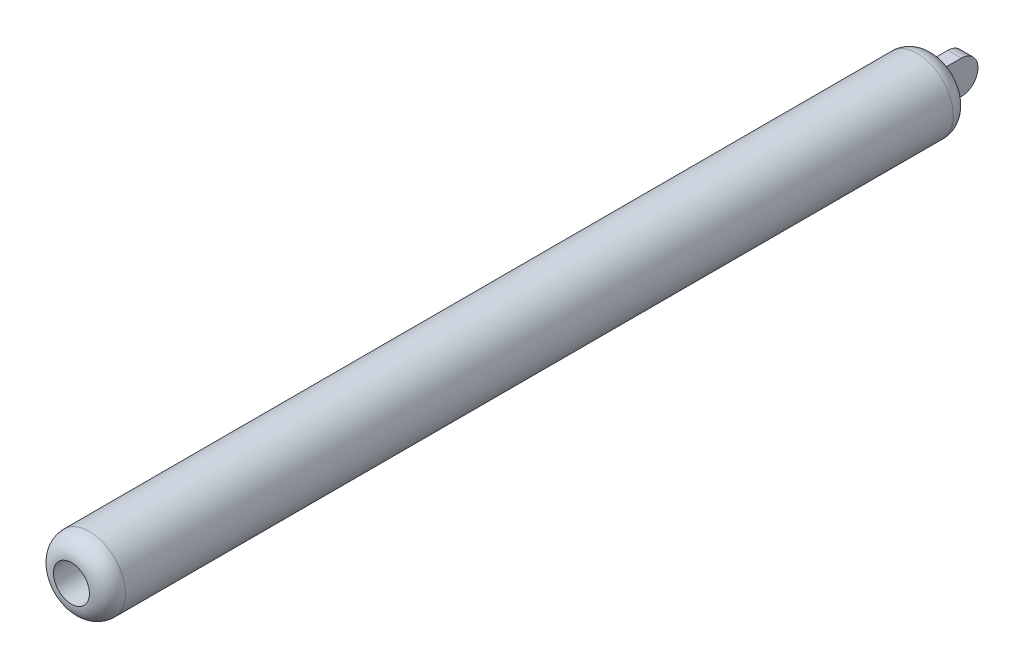
ISO-10303-21;
HEADER;
FILE_DESCRIPTION(('STEP AP214'),'2;1');
FILE_NAME('part.step','',(''),(''),'','','');
FILE_SCHEMA(('AUTOMOTIVE_DESIGN { 1 0 10303 214 1 1 1 1 }'));
ENDSEC;
DATA;
#1=APPLICATION_CONTEXT('core data for automotive mechanical design processes');
#2=APPLICATION_PROTOCOL_DEFINITION('international standard','automotive_design',2000,#1);
#3=PRODUCT_CONTEXT('',#1,'mechanical');
#4=PRODUCT('Part','Part','',(#3));
#5=PRODUCT_RELATED_PRODUCT_CATEGORY('part','',(#4));
#6=PRODUCT_DEFINITION_FORMATION('','',#4);
#7=PRODUCT_DEFINITION_CONTEXT('part definition',#1,'design');
#8=PRODUCT_DEFINITION('design','',#6,#7);
#9=PRODUCT_DEFINITION_SHAPE('','',#8);
#10=(LENGTH_UNIT() NAMED_UNIT(*) SI_UNIT(.MILLI.,.METRE.));
#11=(NAMED_UNIT(*) PLANE_ANGLE_UNIT() SI_UNIT($,.RADIAN.));
#12=(NAMED_UNIT(*) SI_UNIT($,.STERADIAN.) SOLID_ANGLE_UNIT());
#13=UNCERTAINTY_MEASURE_WITH_UNIT(LENGTH_MEASURE(1.E-05),#10,'distance_accuracy_value','');
#14=(GEOMETRIC_REPRESENTATION_CONTEXT(3) GLOBAL_UNCERTAINTY_ASSIGNED_CONTEXT((#13)) GLOBAL_UNIT_ASSIGNED_CONTEXT((#10,
#11,#12)) REPRESENTATION_CONTEXT('',''));
#15=CARTESIAN_POINT('',(0.,0.,0.));
#16=DIRECTION('',(0.,0.,1.));
#17=DIRECTION('',(1.,0.,0.));
#18=AXIS2_PLACEMENT_3D('',#15,#16,#17);
#19=CARTESIAN_POINT('',(-1.190625,0.,-79.6066962254339));
#20=DIRECTION('',(1.,0.,0.));
#21=DIRECTION('',(0.,1.,0.));
#22=AXIS2_PLACEMENT_3D('',#19,#20,#21);
#23=CYLINDRICAL_SURFACE('',#22,2.94330377456609);
#24=CARTESIAN_POINT('',(1.190625,0.,-79.6066962254339));
#25=DIRECTION('',(1.,0.,0.));
#26=DIRECTION('',(0.,0.,1.));
#27=AXIS2_PLACEMENT_3D('',#24,#25,#26);
#28=CIRCLE('',#27,2.94330377456609);
#29=CARTESIAN_POINT('',(1.190625,-2.94330377456609,-79.6066962254339));
#30=VERTEX_POINT('',#29);
#31=CARTESIAN_POINT('',(1.190625,2.94330377456609,-79.6066962254339));
#32=VERTEX_POINT('',#31);
#33=EDGE_CURVE('E33',#30,#32,#28,.T.);
#34=ORIENTED_EDGE('',*,*,#33,.F.);
#35=DIRECTION('',(-1.,0.,0.));
#36=VECTOR('',#35,1.);
#37=CARTESIAN_POINT('',(-1.190625,-2.94330377456609,-79.6066962254339));
#38=LINE('',#37,#36);
#39=CARTESIAN_POINT('',(-1.190625,-2.94330377456609,-79.6066962254339));
#40=VERTEX_POINT('',#39);
#41=EDGE_CURVE('E9',#30,#40,#38,.T.);
#42=ORIENTED_EDGE('',*,*,#41,.T.);
#43=CARTESIAN_POINT('',(-1.190625,0.,-79.6066962254339));
#44=DIRECTION('',(-1.,0.,0.));
#45=DIRECTION('',(0.,1.,0.));
#46=AXIS2_PLACEMENT_3D('',#43,#44,#45);
#47=CIRCLE('',#46,2.94330377456609);
#48=CARTESIAN_POINT('',(-1.190625,2.94330377456609,-79.6066962254339));
#49=VERTEX_POINT('',#48);
#50=EDGE_CURVE('E89',#49,#40,#47,.T.);
#51=ORIENTED_EDGE('',*,*,#50,.F.);
#52=DIRECTION('',(-1.,0.,0.));
#53=VECTOR('',#52,1.);
#54=CARTESIAN_POINT('',(-1.190625,2.94330377456609,-79.6066962254339));
#55=LINE('',#54,#53);
#56=EDGE_CURVE('E88',#32,#49,#55,.T.);
#57=ORIENTED_EDGE('',*,*,#56,.F.);
#58=EDGE_LOOP('',(#34,#42,#51,#57));
#59=FACE_BOUND('',#58,.T.);
#60=ADVANCED_FACE('F15',(#59),#23,.T.);
#61=CARTESIAN_POINT('',(-1.190625,-2.94330377456609,-76.2));
#62=DIRECTION('',(0.,-1.,0.));
#63=DIRECTION('',(0.,0.,-1.));
#64=AXIS2_PLACEMENT_3D('',#61,#62,#63);
#65=PLANE('',#64);
#66=ORIENTED_EDGE('',*,*,#41,.F.);
#67=DIRECTION('',(0.,0.,-1.));
#68=VECTOR('',#67,1.);
#69=CARTESIAN_POINT('',(1.190625,-2.94330377456609,-76.2));
#70=LINE('',#69,#68);
#71=CARTESIAN_POINT('',(1.190625,-2.94330377456609,-76.2));
#72=VERTEX_POINT('',#71);
#73=EDGE_CURVE('E165',#72,#30,#70,.T.);
#74=ORIENTED_EDGE('',*,*,#73,.F.);
#75=DIRECTION('',(1.,0.,0.));
#76=VECTOR('',#75,1.);
#77=CARTESIAN_POINT('',(-0.5953125,-2.94330377456609,-76.2));
#78=LINE('',#77,#76);
#79=CARTESIAN_POINT('',(-1.190625,-2.94330377456609,-76.2));
#80=VERTEX_POINT('',#79);
#81=EDGE_CURVE('E78',#80,#72,#78,.T.);
#82=ORIENTED_EDGE('',*,*,#81,.F.);
#83=DIRECTION('',(0.,0.,-1.));
#84=VECTOR('',#83,1.);
#85=CARTESIAN_POINT('',(-1.190625,-2.94330377456609,-76.2));
#86=LINE('',#85,#84);
#87=EDGE_CURVE('E25',#80,#40,#86,.T.);
#88=ORIENTED_EDGE('',*,*,#87,.T.);
#89=EDGE_LOOP('',(#66,#74,#82,#88));
#90=FACE_BOUND('',#89,.T.);
#91=ADVANCED_FACE('F132',(#90),#65,.T.);
#92=CARTESIAN_POINT('',(1.190625,-2.94330377456609,-76.2));
#93=DIRECTION('',(1.,0.,0.));
#94=DIRECTION('',(0.,1.,0.));
#95=AXIS2_PLACEMENT_3D('',#92,#93,#94);
#96=PLANE('',#95);
#97=ORIENTED_EDGE('',*,*,#33,.T.);
#98=DIRECTION('',(0.,0.,-1.));
#99=VECTOR('',#98,1.);
#100=CARTESIAN_POINT('',(1.190625,2.94330377456609,-76.2));
#101=LINE('',#100,#99);
#102=CARTESIAN_POINT('',(1.190625,2.94330377456609,-76.2));
#103=VERTEX_POINT('',#102);
#104=EDGE_CURVE('E163',#103,#32,#101,.T.);
#105=ORIENTED_EDGE('',*,*,#104,.F.);
#106=DIRECTION('',(0.,1.,0.));
#107=VECTOR('',#106,1.);
#108=CARTESIAN_POINT('',(1.190625,-1.47165188728304,-76.2));
#109=LINE('',#108,#107);
#110=EDGE_CURVE('E102',#72,#103,#109,.T.);
#111=ORIENTED_EDGE('',*,*,#110,.F.);
#112=ORIENTED_EDGE('',*,*,#73,.T.);
#113=EDGE_LOOP('',(#97,#105,#111,#112));
#114=FACE_BOUND('',#113,.T.);
#115=ADVANCED_FACE('F136',(#114),#96,.T.);
#116=CARTESIAN_POINT('',(1.190625,2.94330377456609,-76.2));
#117=DIRECTION('',(0.,1.,0.));
#118=DIRECTION('',(0.,0.,1.));
#119=AXIS2_PLACEMENT_3D('',#116,#117,#118);
#120=PLANE('',#119);
#121=ORIENTED_EDGE('',*,*,#56,.T.);
#122=DIRECTION('',(0.,0.,-1.));
#123=VECTOR('',#122,1.);
#124=CARTESIAN_POINT('',(-1.190625,2.94330377456609,-76.2));
#125=LINE('',#124,#123);
#126=CARTESIAN_POINT('',(-1.190625,2.94330377456609,-76.2));
#127=VERTEX_POINT('',#126);
#128=EDGE_CURVE('E73',#127,#49,#125,.T.);
#129=ORIENTED_EDGE('',*,*,#128,.F.);
#130=DIRECTION('',(-1.,0.,0.));
#131=VECTOR('',#130,1.);
#132=CARTESIAN_POINT('',(0.5953125,2.94330377456609,-76.2));
#133=LINE('',#132,#131);
#134=EDGE_CURVE('E77',#103,#127,#133,.T.);
#135=ORIENTED_EDGE('',*,*,#134,.F.);
#136=ORIENTED_EDGE('',*,*,#104,.T.);
#137=EDGE_LOOP('',(#121,#129,#135,#136));
#138=FACE_BOUND('',#137,.T.);
#139=ADVANCED_FACE('F87',(#138),#120,.T.);
#140=CARTESIAN_POINT('',(-1.190625,2.94330377456609,-76.2));
#141=DIRECTION('',(-1.,0.,0.));
#142=DIRECTION('',(0.,-1.,0.));
#143=AXIS2_PLACEMENT_3D('',#140,#141,#142);
#144=PLANE('',#143);
#145=ORIENTED_EDGE('',*,*,#50,.T.);
#146=ORIENTED_EDGE('',*,*,#87,.F.);
#147=DIRECTION('',(0.,-1.,0.));
#148=VECTOR('',#147,1.);
#149=CARTESIAN_POINT('',(-1.190625,1.47165188728304,-76.2));
#150=LINE('',#149,#148);
#151=EDGE_CURVE('E70',#127,#80,#150,.T.);
#152=ORIENTED_EDGE('',*,*,#151,.F.);
#153=ORIENTED_EDGE('',*,*,#128,.T.);
#154=EDGE_LOOP('',(#145,#146,#152,#153));
#155=FACE_BOUND('',#154,.T.);
#156=ADVANCED_FACE('F71',(#155),#144,.T.);
#157=CARTESIAN_POINT('',(0.,0.,-76.2));
#158=DIRECTION('',(0.,0.,-1.));
#159=DIRECTION('',(-1.,0.,0.));
#160=AXIS2_PLACEMENT_3D('',#157,#158,#159);
#161=PLANE('',#160);
#162=ORIENTED_EDGE('',*,*,#134,.T.);
#163=CARTESIAN_POINT('',(0.,0.,-76.2));
#164=DIRECTION('',(0.,0.,1.));
#165=DIRECTION('',(1.,0.,0.));
#166=AXIS2_PLACEMENT_3D('',#163,#164,#165);
#167=CIRCLE('',#166,3.175);
#168=EDGE_CURVE('E53',#103,#127,#167,.T.);
#169=ORIENTED_EDGE('',*,*,#168,.F.);
#170=EDGE_LOOP('',(#162,#169));
#171=FACE_BOUND('',#170,.T.);
#172=ADVANCED_FACE('F81',(#171),#161,.T.);
#173=CARTESIAN_POINT('',(0.,0.,-76.2));
#174=DIRECTION('',(0.,0.,-1.));
#175=DIRECTION('',(-1.,0.,0.));
#176=AXIS2_PLACEMENT_3D('',#173,#174,#175);
#177=PLANE('',#176);
#178=ORIENTED_EDGE('',*,*,#151,.T.);
#179=CARTESIAN_POINT('',(0.,0.,-76.2));
#180=DIRECTION('',(0.,0.,1.));
#181=DIRECTION('',(1.,0.,0.));
#182=AXIS2_PLACEMENT_3D('',#179,#180,#181);
#183=CIRCLE('',#182,3.175);
#184=EDGE_CURVE('E61',#127,#80,#183,.T.);
#185=ORIENTED_EDGE('',*,*,#184,.F.);
#186=EDGE_LOOP('',(#178,#185));
#187=FACE_BOUND('',#186,.T.);
#188=ADVANCED_FACE('F91',(#187),#177,.T.);
#189=CARTESIAN_POINT('',(0.,0.,-76.2));
#190=DIRECTION('',(0.,0.,-1.));
#191=DIRECTION('',(-1.,0.,0.));
#192=AXIS2_PLACEMENT_3D('',#189,#190,#191);
#193=PLANE('',#192);
#194=ORIENTED_EDGE('',*,*,#81,.T.);
#195=CARTESIAN_POINT('',(0.,0.,-76.2));
#196=DIRECTION('',(0.,0.,1.));
#197=DIRECTION('',(1.,0.,0.));
#198=AXIS2_PLACEMENT_3D('',#195,#196,#197);
#199=CIRCLE('',#198,3.175);
#200=EDGE_CURVE('E92',#80,#72,#199,.T.);
#201=ORIENTED_EDGE('',*,*,#200,.F.);
#202=EDGE_LOOP('',(#194,#201));
#203=FACE_BOUND('',#202,.T.);
#204=ADVANCED_FACE('F144',(#203),#193,.T.);
#205=CARTESIAN_POINT('',(0.,0.,-76.2));
#206=DIRECTION('',(0.,0.,-1.));
#207=DIRECTION('',(-1.,0.,0.));
#208=AXIS2_PLACEMENT_3D('',#205,#206,#207);
#209=PLANE('',#208);
#210=ORIENTED_EDGE('',*,*,#110,.T.);
#211=CARTESIAN_POINT('',(0.,0.,-76.2));
#212=DIRECTION('',(0.,0.,1.));
#213=DIRECTION('',(1.,0.,0.));
#214=AXIS2_PLACEMENT_3D('',#211,#212,#213);
#215=CIRCLE('',#214,3.175);
#216=EDGE_CURVE('E64',#72,#103,#215,.T.);
#217=ORIENTED_EDGE('',*,*,#216,.F.);
#218=EDGE_LOOP('',(#210,#217));
#219=FACE_BOUND('',#218,.T.);
#220=ADVANCED_FACE('F119',(#219),#209,.T.);
#221=CARTESIAN_POINT('',(0.,0.,73.025));
#222=DIRECTION('',(0.,0.,-1.));
#223=DIRECTION('',(0.,-1.,0.));
#224=AXIS2_PLACEMENT_3D('',#221,#222,#223);
#225=DEGENERATE_TOROIDAL_SURFACE('',#224,3.175,3.175,.T.);
#226=CARTESIAN_POINT('',(0.,0.,76.2));
#227=DIRECTION('',(0.,0.,-1.));
#228=DIRECTION('',(0.,-1.,0.));
#229=AXIS2_PLACEMENT_3D('',#226,#227,#228);
#230=CIRCLE('',#229,3.175);
#231=CARTESIAN_POINT('',(0.,-3.175,76.2));
#232=VERTEX_POINT('',#231);
#233=EDGE_CURVE('E99',#232,#232,#230,.T.);
#234=ORIENTED_EDGE('',*,*,#233,.T.);
#235=EDGE_LOOP('',(#234));
#236=FACE_BOUND('',#235,.T.);
#237=CARTESIAN_POINT('',(0.,0.,73.025));
#238=DIRECTION('',(0.,0.,1.));
#239=DIRECTION('',(1.,0.,0.));
#240=AXIS2_PLACEMENT_3D('',#237,#238,#239);
#241=CIRCLE('',#240,6.35);
#242=CARTESIAN_POINT('',(6.35,0.,73.025));
#243=VERTEX_POINT('',#242);
#244=EDGE_CURVE('E98',#243,#243,#241,.T.);
#245=ORIENTED_EDGE('',*,*,#244,.T.);
#246=EDGE_LOOP('',(#245));
#247=FACE_BOUND('',#246,.T.);
#248=ADVANCED_FACE('F115',(#236,#247),#225,.T.);
#249=CARTESIAN_POINT('',(0.,0.,0.));
#250=DIRECTION('',(0.,0.,1.));
#251=DIRECTION('',(1.,0.,0.));
#252=AXIS2_PLACEMENT_3D('',#249,#250,#251);
#253=CYLINDRICAL_SURFACE('',#252,6.35);
#254=CARTESIAN_POINT('',(0.,0.,-73.025));
#255=DIRECTION('',(0.,0.,-1.));
#256=DIRECTION('',(0.,-1.,0.));
#257=AXIS2_PLACEMENT_3D('',#254,#255,#256);
#258=CIRCLE('',#257,6.35);
#259=CARTESIAN_POINT('',(0.,-6.35,-73.025));
#260=VERTEX_POINT('',#259);
#261=EDGE_CURVE('E94',#260,#260,#258,.T.);
#262=ORIENTED_EDGE('',*,*,#261,.F.);
#263=EDGE_LOOP('',(#262));
#264=FACE_BOUND('',#263,.T.);
#265=ORIENTED_EDGE('',*,*,#244,.F.);
#266=EDGE_LOOP('',(#265));
#267=FACE_BOUND('',#266,.T.);
#268=ADVANCED_FACE('F118',(#264,#267),#253,.T.);
#269=CARTESIAN_POINT('',(0.,0.,-73.025));
#270=DIRECTION('',(0.,0.,1.));
#271=DIRECTION('',(1.,0.,0.));
#272=AXIS2_PLACEMENT_3D('',#269,#270,#271);
#273=DEGENERATE_TOROIDAL_SURFACE('',#272,3.175,3.175,.T.);
#274=ORIENTED_EDGE('',*,*,#216,.T.);
#275=ORIENTED_EDGE('',*,*,#168,.T.);
#276=ORIENTED_EDGE('',*,*,#184,.T.);
#277=ORIENTED_EDGE('',*,*,#200,.T.);
#278=EDGE_LOOP('',(#274,#275,#276,#277));
#279=FACE_BOUND('',#278,.T.);
#280=ORIENTED_EDGE('',*,*,#261,.T.);
#281=EDGE_LOOP('',(#280));
#282=FACE_BOUND('',#281,.T.);
#283=ADVANCED_FACE('F58',(#279,#282),#273,.T.);
#284=CARTESIAN_POINT('',(0.,0.,76.2));
#285=DIRECTION('',(0.,0.,-1.));
#286=DIRECTION('',(0.,-1.,0.));
#287=AXIS2_PLACEMENT_3D('',#284,#285,#286);
#288=CYLINDRICAL_SURFACE('',#287,3.175);
#289=CARTESIAN_POINT('',(0.,0.,-63.5));
#290=DIRECTION('',(0.,0.,1.));
#291=DIRECTION('',(1.,0.,0.));
#292=AXIS2_PLACEMENT_3D('',#289,#290,#291);
#293=CIRCLE('',#292,3.175);
#294=CARTESIAN_POINT('',(3.175,0.,-63.5));
#295=VERTEX_POINT('',#294);
#296=EDGE_CURVE('E19',#295,#295,#293,.T.);
#297=ORIENTED_EDGE('',*,*,#296,.F.);
#298=EDGE_LOOP('',(#297));
#299=FACE_BOUND('',#298,.T.);
#300=ORIENTED_EDGE('',*,*,#233,.F.);
#301=EDGE_LOOP('',(#300));
#302=FACE_BOUND('',#301,.T.);
#303=ADVANCED_FACE('F17',(#299,#302),#288,.F.);
#304=CARTESIAN_POINT('',(0.,0.,-63.5));
#305=DIRECTION('',(0.,0.,-1.));
#306=DIRECTION('',(-1.,0.,0.));
#307=AXIS2_PLACEMENT_3D('',#304,#305,#306);
#308=PLANE('',#307);
#309=ORIENTED_EDGE('',*,*,#296,.T.);
#310=EDGE_LOOP('',(#309));
#311=FACE_BOUND('',#310,.T.);
#312=ADVANCED_FACE('F109',(#311),#308,.F.);
#313=CLOSED_SHELL('',(#60,#91,#115,#139,#156,#172,#188,#204,#220,#248,#268,#283,#303,#312));
#314=MANIFOLD_SOLID_BREP('B1',#313);
#315=ADVANCED_BREP_SHAPE_REPRESENTATION('',(#18,#314),#14);
#316=SHAPE_DEFINITION_REPRESENTATION(#9,#315);
ENDSEC;
END-ISO-10303-21;
